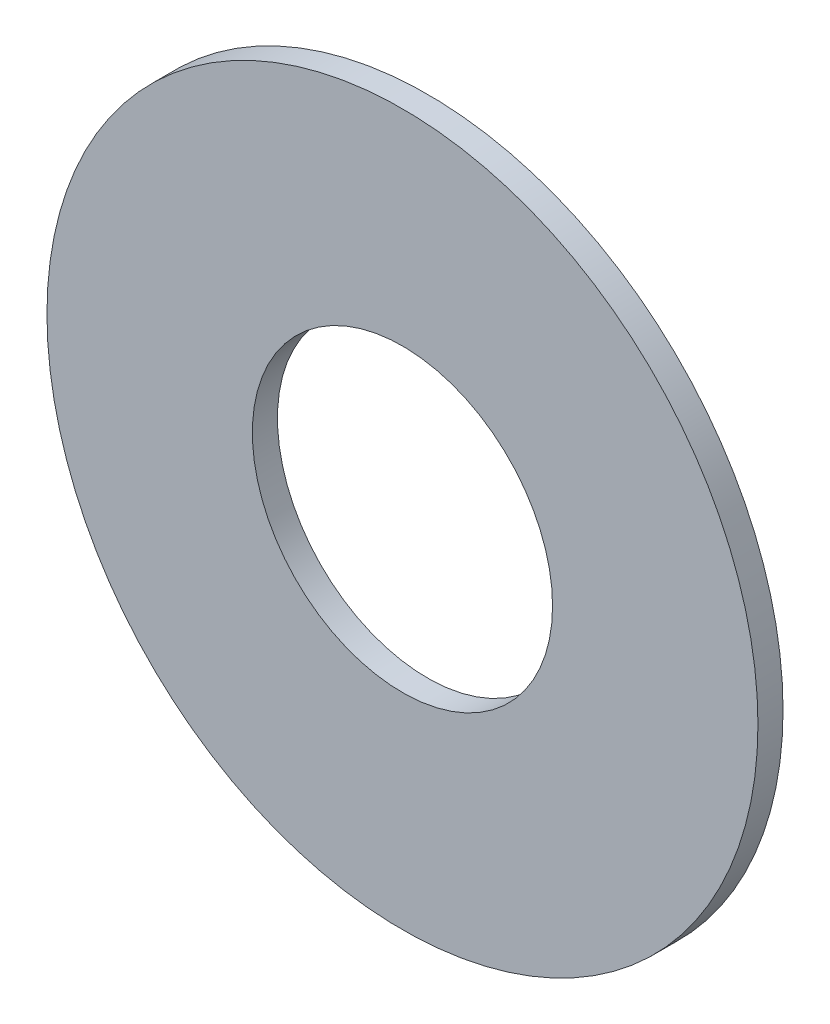
ISO-10303-21;
HEADER;
FILE_DESCRIPTION(('STEP AP214'),'2;1');
FILE_NAME('part.step','',(''),(''),'','','');
FILE_SCHEMA(('AUTOMOTIVE_DESIGN { 1 0 10303 214 1 1 1 1 }'));
ENDSEC;
DATA;
#1=APPLICATION_CONTEXT('core data for automotive mechanical design processes');
#2=APPLICATION_PROTOCOL_DEFINITION('international standard','automotive_design',2000,#1);
#3=PRODUCT_CONTEXT('',#1,'mechanical');
#4=PRODUCT('Part','Part','',(#3));
#5=PRODUCT_RELATED_PRODUCT_CATEGORY('part','',(#4));
#6=PRODUCT_DEFINITION_FORMATION('','',#4);
#7=PRODUCT_DEFINITION_CONTEXT('part definition',#1,'design');
#8=PRODUCT_DEFINITION('design','',#6,#7);
#9=PRODUCT_DEFINITION_SHAPE('','',#8);
#10=(LENGTH_UNIT() NAMED_UNIT(*) SI_UNIT(.MILLI.,.METRE.));
#11=(NAMED_UNIT(*) PLANE_ANGLE_UNIT() SI_UNIT($,.RADIAN.));
#12=(NAMED_UNIT(*) SI_UNIT($,.STERADIAN.) SOLID_ANGLE_UNIT());
#13=UNCERTAINTY_MEASURE_WITH_UNIT(LENGTH_MEASURE(1.E-05),#10,'distance_accuracy_value','');
#14=(GEOMETRIC_REPRESENTATION_CONTEXT(3) GLOBAL_UNCERTAINTY_ASSIGNED_CONTEXT((#13)) GLOBAL_UNIT_ASSIGNED_CONTEXT((#10,
#11,#12)) REPRESENTATION_CONTEXT('',''));
#15=CARTESIAN_POINT('',(0.,0.,0.));
#16=DIRECTION('',(0.,0.,1.));
#17=DIRECTION('',(1.,0.,0.));
#18=AXIS2_PLACEMENT_3D('',#15,#16,#17);
#19=CARTESIAN_POINT('',(0.,0.,0.79375));
#20=DIRECTION('',(0.,0.,1.));
#21=DIRECTION('',(1.,0.,0.));
#22=AXIS2_PLACEMENT_3D('',#19,#20,#21);
#23=PLANE('',#22);
#24=CARTESIAN_POINT('',(0.,0.,0.79375));
#25=DIRECTION('',(0.,0.,1.));
#26=DIRECTION('',(1.,0.,0.));
#27=AXIS2_PLACEMENT_3D('',#24,#25,#26);
#28=CIRCLE('',#27,11.25);
#29=CARTESIAN_POINT('',(11.25,0.,0.79375));
#30=VERTEX_POINT('',#29);
#31=EDGE_CURVE('E10',#30,#30,#28,.T.);
#32=ORIENTED_EDGE('',*,*,#31,.T.);
#33=EDGE_LOOP('',(#32));
#34=FACE_BOUND('',#33,.T.);
#35=CARTESIAN_POINT('',(0.,0.,0.79375));
#36=DIRECTION('',(0.,0.,1.));
#37=DIRECTION('',(1.,0.,0.));
#38=AXIS2_PLACEMENT_3D('',#35,#36,#37);
#39=CIRCLE('',#38,4.75);
#40=CARTESIAN_POINT('',(4.75,0.,0.79375));
#41=VERTEX_POINT('',#40);
#42=EDGE_CURVE('E42',#41,#41,#39,.T.);
#43=ORIENTED_EDGE('',*,*,#42,.F.);
#44=EDGE_LOOP('',(#43));
#45=FACE_BOUND('',#44,.T.);
#46=ADVANCED_FACE('F31',(#34,#45),#23,.T.);
#47=CARTESIAN_POINT('',(0.,0.,0.));
#48=DIRECTION('',(0.,0.,1.));
#49=DIRECTION('',(1.,0.,0.));
#50=AXIS2_PLACEMENT_3D('',#47,#48,#49);
#51=PLANE('',#50);
#52=CARTESIAN_POINT('',(0.,0.,0.));
#53=DIRECTION('',(0.,0.,1.));
#54=DIRECTION('',(1.,0.,0.));
#55=AXIS2_PLACEMENT_3D('',#52,#53,#54);
#56=CIRCLE('',#55,11.25);
#57=CARTESIAN_POINT('',(11.25,0.,0.));
#58=VERTEX_POINT('',#57);
#59=EDGE_CURVE('E35',#58,#58,#56,.T.);
#60=ORIENTED_EDGE('',*,*,#59,.F.);
#61=EDGE_LOOP('',(#60));
#62=FACE_BOUND('',#61,.T.);
#63=CARTESIAN_POINT('',(0.,0.,0.));
#64=DIRECTION('',(0.,0.,1.));
#65=DIRECTION('',(1.,0.,0.));
#66=AXIS2_PLACEMENT_3D('',#63,#64,#65);
#67=CIRCLE('',#66,4.75);
#68=CARTESIAN_POINT('',(4.75,0.,0.));
#69=VERTEX_POINT('',#68);
#70=EDGE_CURVE('E44',#69,#69,#67,.T.);
#71=ORIENTED_EDGE('',*,*,#70,.T.);
#72=EDGE_LOOP('',(#71));
#73=FACE_BOUND('',#72,.T.);
#74=ADVANCED_FACE('F54',(#62,#73),#51,.F.);
#75=CARTESIAN_POINT('',(0.,0.,0.79375));
#76=DIRECTION('',(0.,0.,-1.));
#77=DIRECTION('',(-1.,0.,0.));
#78=AXIS2_PLACEMENT_3D('',#75,#76,#77);
#79=CYLINDRICAL_SURFACE('',#78,11.25);
#80=ORIENTED_EDGE('',*,*,#31,.F.);
#81=EDGE_LOOP('',(#80));
#82=FACE_BOUND('',#81,.T.);
#83=ORIENTED_EDGE('',*,*,#59,.T.);
#84=EDGE_LOOP('',(#83));
#85=FACE_BOUND('',#84,.T.);
#86=ADVANCED_FACE('F33',(#82,#85),#79,.T.);
#87=CARTESIAN_POINT('',(0.,0.,0.79375));
#88=DIRECTION('',(0.,0.,-1.));
#89=DIRECTION('',(-1.,0.,0.));
#90=AXIS2_PLACEMENT_3D('',#87,#88,#89);
#91=CYLINDRICAL_SURFACE('',#90,4.75);
#92=ORIENTED_EDGE('',*,*,#42,.T.);
#93=EDGE_LOOP('',(#92));
#94=FACE_BOUND('',#93,.T.);
#95=ORIENTED_EDGE('',*,*,#70,.F.);
#96=EDGE_LOOP('',(#95));
#97=FACE_BOUND('',#96,.T.);
#98=ADVANCED_FACE('F50',(#94,#97),#91,.F.);
#99=CLOSED_SHELL('',(#46,#74,#86,#98));
#100=MANIFOLD_SOLID_BREP('B2',#99);
#101=ADVANCED_BREP_SHAPE_REPRESENTATION('',(#18,#100),#14);
#102=SHAPE_DEFINITION_REPRESENTATION(#9,#101);
ENDSEC;
END-ISO-10303-21;
